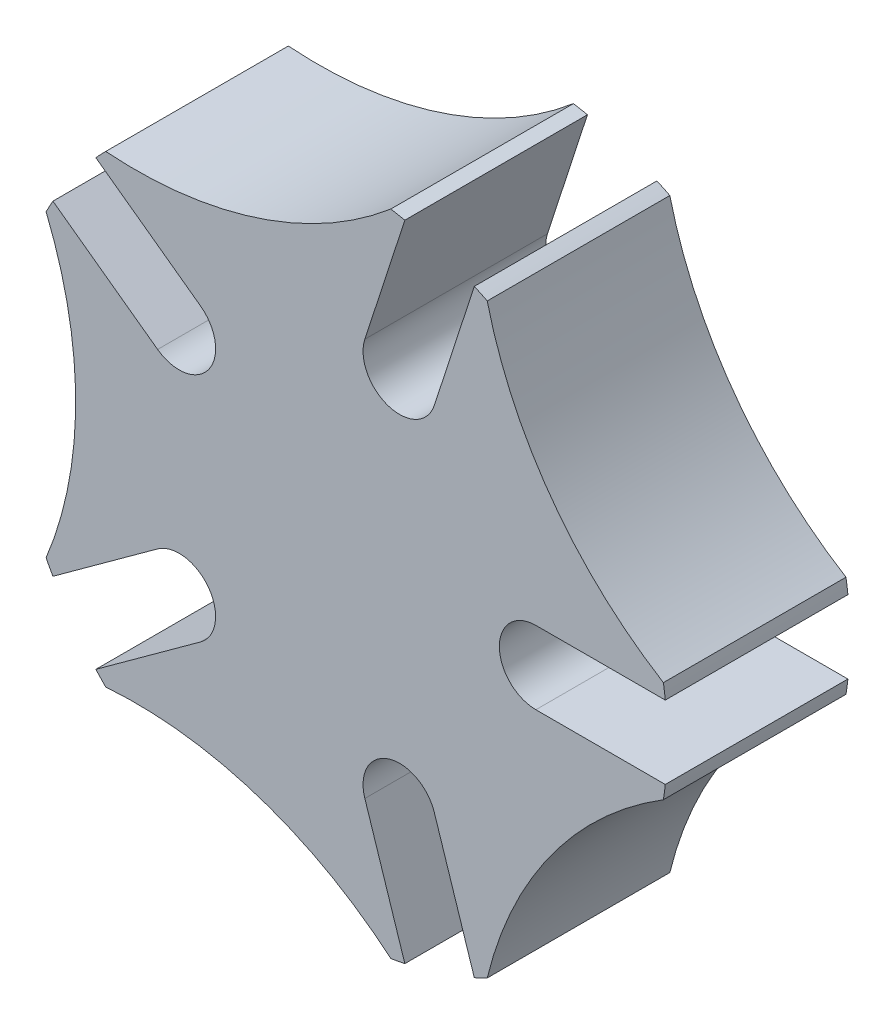
ISO-10303-21;
HEADER;
FILE_DESCRIPTION(('STEP AP214'),'2;1');
FILE_NAME('part.step','',(''),(''),'','','');
FILE_SCHEMA(('AUTOMOTIVE_DESIGN { 1 0 10303 214 1 1 1 1 }'));
ENDSEC;
DATA;
#1=APPLICATION_CONTEXT('core data for automotive mechanical design processes');
#2=APPLICATION_PROTOCOL_DEFINITION('international standard','automotive_design',2000,#1);
#3=PRODUCT_CONTEXT('',#1,'mechanical');
#4=PRODUCT('Part','Part','',(#3));
#5=PRODUCT_RELATED_PRODUCT_CATEGORY('part','',(#4));
#6=PRODUCT_DEFINITION_FORMATION('','',#4);
#7=PRODUCT_DEFINITION_CONTEXT('part definition',#1,'design');
#8=PRODUCT_DEFINITION('design','',#6,#7);
#9=PRODUCT_DEFINITION_SHAPE('','',#8);
#10=(LENGTH_UNIT() NAMED_UNIT(*) SI_UNIT(.MILLI.,.METRE.));
#11=(NAMED_UNIT(*) PLANE_ANGLE_UNIT() SI_UNIT($,.RADIAN.));
#12=(NAMED_UNIT(*) SI_UNIT($,.STERADIAN.) SOLID_ANGLE_UNIT());
#13=UNCERTAINTY_MEASURE_WITH_UNIT(LENGTH_MEASURE(1.E-05),#10,'distance_accuracy_value','');
#14=(GEOMETRIC_REPRESENTATION_CONTEXT(3) GLOBAL_UNCERTAINTY_ASSIGNED_CONTEXT((#13)) GLOBAL_UNIT_ASSIGNED_CONTEXT((#10,
#11,#12)) REPRESENTATION_CONTEXT('',''));
#15=CARTESIAN_POINT('',(0.,0.,0.));
#16=DIRECTION('',(0.,0.,1.));
#17=DIRECTION('',(1.,0.,0.));
#18=AXIS2_PLACEMENT_3D('',#15,#16,#17);
#19=CARTESIAN_POINT('',(-4.36869176962471,3.17404036237936,5.));
#20=DIRECTION('',(0.,0.,-1.));
#21=DIRECTION('',(-1.,0.,0.));
#22=AXIS2_PLACEMENT_3D('',#19,#20,#21);
#23=CYLINDRICAL_SURFACE('',#22,0.999999999999999);
#24=CARTESIAN_POINT('',(-4.36869176962471,3.17404036237936,0.));
#25=DIRECTION('',(0.,0.,1.));
#26=DIRECTION('',(1.,0.,0.));
#27=AXIS2_PLACEMENT_3D('',#24,#25,#26);
#28=CIRCLE('',#27,0.999999999999999);
#29=CARTESIAN_POINT('',(-4.95647702191719,2.36502336800441,0.));
#30=VERTEX_POINT('',#29);
#31=CARTESIAN_POINT('',(-3.78090651733224,3.98305735675431,0.));
#32=VERTEX_POINT('',#31);
#33=EDGE_CURVE('E264',#30,#32,#28,.T.);
#34=ORIENTED_EDGE('',*,*,#33,.F.);
#35=DIRECTION('',(0.,0.,-1.));
#36=VECTOR('',#35,1.);
#37=CARTESIAN_POINT('',(-4.95647702191719,2.36502336800441,5.));
#38=LINE('',#37,#36);
#39=CARTESIAN_POINT('',(-4.95647702191719,2.36502336800441,5.));
#40=VERTEX_POINT('',#39);
#41=EDGE_CURVE('E11',#40,#30,#38,.T.);
#42=ORIENTED_EDGE('',*,*,#41,.F.);
#43=CARTESIAN_POINT('',(-4.36869176962471,3.17404036237936,5.));
#44=DIRECTION('',(0.,0.,1.));
#45=DIRECTION('',(1.,0.,0.));
#46=AXIS2_PLACEMENT_3D('',#43,#44,#45);
#47=CIRCLE('',#46,0.999999999999999);
#48=CARTESIAN_POINT('',(-3.78090651733224,3.98305735675431,5.));
#49=VERTEX_POINT('',#48);
#50=EDGE_CURVE('E328',#40,#49,#47,.T.);
#51=ORIENTED_EDGE('',*,*,#50,.T.);
#52=DIRECTION('',(0.,0.,-1.));
#53=VECTOR('',#52,1.);
#54=CARTESIAN_POINT('',(-3.78090651733224,3.98305735675431,5.));
#55=LINE('',#54,#53);
#56=EDGE_CURVE('E51',#49,#32,#55,.T.);
#57=ORIENTED_EDGE('',*,*,#56,.T.);
#58=EDGE_LOOP('',(#34,#42,#51,#57));
#59=FACE_BOUND('',#58,.T.);
#60=ADVANCED_FACE('F35',(#59),#23,.F.);
#61=CARTESIAN_POINT('',(-0.587785252292473,-0.809016994374945,5.));
#62=DIRECTION('',(-0.587785252292474,-0.809016994374947,0.));
#63=DIRECTION('',(0.809016994374947,-0.587785252292474,0.));
#64=AXIS2_PLACEMENT_3D('',#61,#62,#63);
#65=PLANE('',#64);
#66=DIRECTION('',(-0.809016994374947,0.587785252292474,0.));
#67=VECTOR('',#66,1.);
#68=CARTESIAN_POINT('',(-0.587785252292473,-0.809016994374945,0.));
#69=LINE('',#68,#67);
#70=CARTESIAN_POINT('',(-7.8234126972888,4.44797406121767,0.));
#71=VERTEX_POINT('',#70);
#72=EDGE_CURVE('E266',#30,#71,#69,.T.);
#73=ORIENTED_EDGE('',*,*,#72,.T.);
#74=DIRECTION('',(0.,0.,-1.));
#75=VECTOR('',#74,1.);
#76=CARTESIAN_POINT('',(-7.8234126972888,4.44797406121767,5.));
#77=LINE('',#76,#75);
#78=CARTESIAN_POINT('',(-7.8234126972888,4.44797406121767,5.));
#79=VERTEX_POINT('',#78);
#80=EDGE_CURVE('E43',#79,#71,#77,.T.);
#81=ORIENTED_EDGE('',*,*,#80,.F.);
#82=DIRECTION('',(-0.809016994374947,0.587785252292474,0.));
#83=VECTOR('',#82,1.);
#84=CARTESIAN_POINT('',(-0.587785252292473,-0.809016994374945,5.));
#85=LINE('',#84,#83);
#86=EDGE_CURVE('E407',#40,#79,#85,.T.);
#87=ORIENTED_EDGE('',*,*,#86,.F.);
#88=ORIENTED_EDGE('',*,*,#41,.T.);
#89=EDGE_LOOP('',(#73,#81,#87,#88));
#90=FACE_BOUND('',#89,.T.);
#91=ADVANCED_FACE('F473',(#90),#65,.F.);
#92=CARTESIAN_POINT('',(0.,0.,5.));
#93=DIRECTION('',(0.,0.,-1.));
#94=DIRECTION('',(-1.,0.,0.));
#95=AXIS2_PLACEMENT_3D('',#92,#93,#94);
#96=CYLINDRICAL_SURFACE('',#95,8.99945884380638);
#97=CARTESIAN_POINT('',(0.,0.,0.));
#98=DIRECTION('',(0.,0.,1.));
#99=DIRECTION('',(1.,0.,0.));
#100=AXIS2_PLACEMENT_3D('',#97,#98,#99);
#101=CIRCLE('',#100,8.99945884380638);
#102=CARTESIAN_POINT('',(-8.00972943003791,4.10298597840029,0.));
#103=VERTEX_POINT('',#102);
#104=EDGE_CURVE('E268',#71,#103,#101,.T.);
#105=ORIENTED_EDGE('',*,*,#104,.T.);
#106=DIRECTION('',(0.,0.,-1.));
#107=VECTOR('',#106,1.);
#108=CARTESIAN_POINT('',(-8.00972943003791,4.10298597840029,5.));
#109=LINE('',#108,#107);
#110=CARTESIAN_POINT('',(-8.00972943003791,4.10298597840029,5.));
#111=VERTEX_POINT('',#110);
#112=EDGE_CURVE('E382',#111,#103,#109,.T.);
#113=ORIENTED_EDGE('',*,*,#112,.F.);
#114=CARTESIAN_POINT('',(0.,0.,5.));
#115=DIRECTION('',(0.,0.,1.));
#116=DIRECTION('',(1.,0.,0.));
#117=AXIS2_PLACEMENT_3D('',#114,#115,#116);
#118=CIRCLE('',#117,8.99945884380638);
#119=EDGE_CURVE('E252',#79,#111,#118,.T.);
#120=ORIENTED_EDGE('',*,*,#119,.F.);
#121=ORIENTED_EDGE('',*,*,#80,.T.);
#122=EDGE_LOOP('',(#105,#113,#120,#121));
#123=FACE_BOUND('',#122,.T.);
#124=ADVANCED_FACE('F388',(#123),#96,.T.);
#125=CARTESIAN_POINT('',(-18.,0.,5.));
#126=DIRECTION('',(0.,0.,-1.));
#127=DIRECTION('',(-1.,0.,0.));
#128=AXIS2_PLACEMENT_3D('',#125,#126,#127);
#129=CYLINDRICAL_SURFACE('',#128,10.8);
#130=CARTESIAN_POINT('',(-18.,0.,0.));
#131=DIRECTION('',(0.,0.,1.));
#132=DIRECTION('',(1.,0.,0.));
#133=AXIS2_PLACEMENT_3D('',#130,#131,#132);
#134=CIRCLE('',#133,10.8);
#135=CARTESIAN_POINT('',(-8.00972943003791,-4.1029859784003,0.));
#136=VERTEX_POINT('',#135);
#137=EDGE_CURVE('E271',#136,#103,#134,.T.);
#138=ORIENTED_EDGE('',*,*,#137,.F.);
#139=DIRECTION('',(0.,0.,-1.));
#140=VECTOR('',#139,1.);
#141=CARTESIAN_POINT('',(-8.00972943003791,-4.1029859784003,5.));
#142=LINE('',#141,#140);
#143=CARTESIAN_POINT('',(-8.00972943003791,-4.1029859784003,5.));
#144=VERTEX_POINT('',#143);
#145=EDGE_CURVE('E380',#144,#136,#142,.T.);
#146=ORIENTED_EDGE('',*,*,#145,.F.);
#147=CARTESIAN_POINT('',(-18.,0.,5.));
#148=DIRECTION('',(0.,0.,1.));
#149=DIRECTION('',(1.,0.,0.));
#150=AXIS2_PLACEMENT_3D('',#147,#148,#149);
#151=CIRCLE('',#150,10.8);
#152=EDGE_CURVE('E402',#144,#111,#151,.T.);
#153=ORIENTED_EDGE('',*,*,#152,.T.);
#154=ORIENTED_EDGE('',*,*,#112,.T.);
#155=EDGE_LOOP('',(#138,#146,#153,#154));
#156=FACE_BOUND('',#155,.T.);
#157=ADVANCED_FACE('F398',(#156),#129,.F.);
#158=CARTESIAN_POINT('',(-7.8234126972887,-4.44797406121786,0.));
#159=VERTEX_POINT('',#158);
#160=EDGE_CURVE('E273',#136,#159,#101,.T.);
#161=ORIENTED_EDGE('',*,*,#160,.T.);
#162=DIRECTION('',(0.,0.,-1.));
#163=VECTOR('',#162,1.);
#164=CARTESIAN_POINT('',(-7.8234126972887,-4.44797406121786,5.));
#165=LINE('',#164,#163);
#166=CARTESIAN_POINT('',(-7.8234126972887,-4.44797406121786,5.));
#167=VERTEX_POINT('',#166);
#168=EDGE_CURVE('E378',#167,#159,#165,.T.);
#169=ORIENTED_EDGE('',*,*,#168,.F.);
#170=EDGE_CURVE('E403',#144,#167,#118,.T.);
#171=ORIENTED_EDGE('',*,*,#170,.F.);
#172=ORIENTED_EDGE('',*,*,#145,.T.);
#173=EDGE_LOOP('',(#161,#169,#171,#172));
#174=FACE_BOUND('',#173,.T.);
#175=ADVANCED_FACE('F480',(#174),#96,.T.);
#176=CARTESIAN_POINT('',(-0.587785252292336,0.80901699437476,5.));
#177=DIRECTION('',(0.587785252292472,-0.809016994374948,0.));
#178=DIRECTION('',(0.809016994374948,0.587785252292472,0.));
#179=AXIS2_PLACEMENT_3D('',#176,#177,#178);
#180=PLANE('',#179);
#181=DIRECTION('',(-0.809016994374948,-0.587785252292472,0.));
#182=VECTOR('',#181,1.);
#183=CARTESIAN_POINT('',(-0.587785252292336,0.80901699437476,0.));
#184=LINE('',#183,#182);
#185=CARTESIAN_POINT('',(-4.95647702191687,-2.36502336800445,0.));
#186=VERTEX_POINT('',#185);
#187=EDGE_CURVE('E276',#186,#159,#184,.T.);
#188=ORIENTED_EDGE('',*,*,#187,.F.);
#189=DIRECTION('',(0.,0.,-1.));
#190=VECTOR('',#189,1.);
#191=CARTESIAN_POINT('',(-4.95647702191687,-2.36502336800445,5.));
#192=LINE('',#191,#190);
#193=CARTESIAN_POINT('',(-4.95647702191687,-2.36502336800445,5.));
#194=VERTEX_POINT('',#193);
#195=EDGE_CURVE('E376',#194,#186,#192,.T.);
#196=ORIENTED_EDGE('',*,*,#195,.F.);
#197=DIRECTION('',(-0.809016994374948,-0.587785252292472,0.));
#198=VECTOR('',#197,1.);
#199=CARTESIAN_POINT('',(-0.587785252292336,0.80901699437476,5.));
#200=LINE('',#199,#198);
#201=EDGE_CURVE('E405',#194,#167,#200,.T.);
#202=ORIENTED_EDGE('',*,*,#201,.T.);
#203=ORIENTED_EDGE('',*,*,#168,.T.);
#204=EDGE_LOOP('',(#188,#196,#202,#203));
#205=FACE_BOUND('',#204,.T.);
#206=ADVANCED_FACE('F484',(#205),#180,.T.);
#207=CARTESIAN_POINT('',(-4.36869176962439,-3.1740403623794,5.));
#208=DIRECTION('',(0.,0.,-1.));
#209=DIRECTION('',(-1.,0.,0.));
#210=AXIS2_PLACEMENT_3D('',#207,#208,#209);
#211=CYLINDRICAL_SURFACE('',#210,1.);
#212=CARTESIAN_POINT('',(-4.36869176962439,-3.1740403623794,0.));
#213=DIRECTION('',(0.,0.,1.));
#214=DIRECTION('',(1.,0.,0.));
#215=AXIS2_PLACEMENT_3D('',#212,#213,#214);
#216=CIRCLE('',#215,1.);
#217=CARTESIAN_POINT('',(-3.78090651733192,-3.98305735675435,0.));
#218=VERTEX_POINT('',#217);
#219=EDGE_CURVE('E279',#218,#186,#216,.T.);
#220=ORIENTED_EDGE('',*,*,#219,.F.);
#221=DIRECTION('',(0.,0.,-1.));
#222=VECTOR('',#221,1.);
#223=CARTESIAN_POINT('',(-3.78090651733192,-3.98305735675435,5.));
#224=LINE('',#223,#222);
#225=CARTESIAN_POINT('',(-3.78090651733192,-3.98305735675435,5.));
#226=VERTEX_POINT('',#225);
#227=EDGE_CURVE('E374',#226,#218,#224,.T.);
#228=ORIENTED_EDGE('',*,*,#227,.F.);
#229=CARTESIAN_POINT('',(-4.36869176962439,-3.1740403623794,5.));
#230=DIRECTION('',(0.,0.,1.));
#231=DIRECTION('',(1.,0.,0.));
#232=AXIS2_PLACEMENT_3D('',#229,#230,#231);
#233=CIRCLE('',#232,1.);
#234=EDGE_CURVE('E412',#226,#194,#233,.T.);
#235=ORIENTED_EDGE('',*,*,#234,.T.);
#236=ORIENTED_EDGE('',*,*,#195,.T.);
#237=EDGE_LOOP('',(#220,#228,#235,#236));
#238=FACE_BOUND('',#237,.T.);
#239=ADVANCED_FACE('F487',(#238),#211,.F.);
#240=CARTESIAN_POINT('',(0.587785252292611,-0.809016994375141,5.));
#241=DIRECTION('',(0.587785252292472,-0.809016994374948,0.));
#242=DIRECTION('',(0.809016994374948,0.587785252292472,0.));
#243=AXIS2_PLACEMENT_3D('',#240,#241,#242);
#244=PLANE('',#243);
#245=DIRECTION('',(-0.809016994374949,-0.587785252292472,0.));
#246=VECTOR('',#245,1.);
#247=CARTESIAN_POINT('',(0.587785252292611,-0.809016994375141,0.));
#248=LINE('',#247,#246);
#249=CARTESIAN_POINT('',(-6.64784219270371,-6.06600804996772,0.));
#250=VERTEX_POINT('',#249);
#251=EDGE_CURVE('E282',#218,#250,#248,.T.);
#252=ORIENTED_EDGE('',*,*,#251,.T.);
#253=DIRECTION('',(0.,0.,-1.));
#254=VECTOR('',#253,1.);
#255=CARTESIAN_POINT('',(-6.64784219270371,-6.06600804996772,5.));
#256=LINE('',#255,#254);
#257=CARTESIAN_POINT('',(-6.64784219270371,-6.06600804996772,5.));
#258=VERTEX_POINT('',#257);
#259=EDGE_CURVE('E371',#258,#250,#256,.T.);
#260=ORIENTED_EDGE('',*,*,#259,.F.);
#261=DIRECTION('',(-0.809016994374949,-0.587785252292472,0.));
#262=VECTOR('',#261,1.);
#263=CARTESIAN_POINT('',(0.587785252292611,-0.809016994375141,5.));
#264=LINE('',#263,#262);
#265=EDGE_CURVE('E415',#226,#258,#264,.T.);
#266=ORIENTED_EDGE('',*,*,#265,.F.);
#267=ORIENTED_EDGE('',*,*,#227,.T.);
#268=EDGE_LOOP('',(#252,#260,#266,#267));
#269=FACE_BOUND('',#268,.T.);
#270=ADVANCED_FACE('F491',(#269),#244,.F.);
#271=CARTESIAN_POINT('',(-6.3773140652522,-6.34981297319074,0.));
#272=VERTEX_POINT('',#271);
#273=EDGE_CURVE('E284',#250,#272,#101,.T.);
#274=ORIENTED_EDGE('',*,*,#273,.T.);
#275=DIRECTION('',(0.,0.,-1.));
#276=VECTOR('',#275,1.);
#277=CARTESIAN_POINT('',(-6.3773140652522,-6.34981297319074,5.));
#278=LINE('',#277,#276);
#279=CARTESIAN_POINT('',(-6.3773140652522,-6.34981297319074,5.));
#280=VERTEX_POINT('',#279);
#281=EDGE_CURVE('E369',#280,#272,#278,.T.);
#282=ORIENTED_EDGE('',*,*,#281,.F.);
#283=EDGE_CURVE('E406',#258,#280,#118,.T.);
#284=ORIENTED_EDGE('',*,*,#283,.F.);
#285=ORIENTED_EDGE('',*,*,#259,.T.);
#286=EDGE_LOOP('',(#274,#282,#284,#285));
#287=FACE_BOUND('',#286,.T.);
#288=ADVANCED_FACE('F495',(#287),#96,.T.);
#289=CARTESIAN_POINT('',(-5.56230589874925,-17.1190172933127,5.));
#290=DIRECTION('',(0.,0.,-1.));
#291=DIRECTION('',(-1.,0.,0.));
#292=AXIS2_PLACEMENT_3D('',#289,#290,#291);
#293=CYLINDRICAL_SURFACE('',#292,10.8);
#294=CARTESIAN_POINT('',(-5.56230589874925,-17.1190172933127,0.));
#295=DIRECTION('',(0.,0.,1.));
#296=DIRECTION('',(1.,0.,0.));
#297=AXIS2_PLACEMENT_3D('',#294,#295,#296);
#298=CIRCLE('',#297,10.8);
#299=CARTESIAN_POINT('',(1.42702903679827,-8.88559776320645,0.));
#300=VERTEX_POINT('',#299);
#301=EDGE_CURVE('E285',#300,#272,#298,.T.);
#302=ORIENTED_EDGE('',*,*,#301,.F.);
#303=DIRECTION('',(0.,0.,-1.));
#304=VECTOR('',#303,1.);
#305=CARTESIAN_POINT('',(1.42702903679827,-8.88559776320645,5.));
#306=LINE('',#305,#304);
#307=CARTESIAN_POINT('',(1.42702903679827,-8.88559776320645,5.));
#308=VERTEX_POINT('',#307);
#309=EDGE_CURVE('E367',#308,#300,#306,.T.);
#310=ORIENTED_EDGE('',*,*,#309,.F.);
#311=CARTESIAN_POINT('',(-5.56230589874925,-17.1190172933127,5.));
#312=DIRECTION('',(0.,0.,1.));
#313=DIRECTION('',(1.,0.,0.));
#314=AXIS2_PLACEMENT_3D('',#311,#312,#313);
#315=CIRCLE('',#314,10.8);
#316=EDGE_CURVE('E417',#308,#280,#315,.T.);
#317=ORIENTED_EDGE('',*,*,#316,.T.);
#318=ORIENTED_EDGE('',*,*,#281,.T.);
#319=EDGE_LOOP('',(#302,#310,#317,#318));
#320=FACE_BOUND('',#319,.T.);
#321=ADVANCED_FACE('F497',(#320),#293,.F.);
#322=CARTESIAN_POINT('',(1.8127072377624,-8.81500720087787,0.));
#323=VERTEX_POINT('',#322);
#324=EDGE_CURVE('E288',#300,#323,#101,.T.);
#325=ORIENTED_EDGE('',*,*,#324,.T.);
#326=DIRECTION('',(0.,0.,-1.));
#327=VECTOR('',#326,1.);
#328=CARTESIAN_POINT('',(1.8127072377624,-8.81500720087787,5.));
#329=LINE('',#328,#327);
#330=CARTESIAN_POINT('',(1.8127072377624,-8.81500720087787,5.));
#331=VERTEX_POINT('',#330);
#332=EDGE_CURVE('E365',#331,#323,#329,.T.);
#333=ORIENTED_EDGE('',*,*,#332,.F.);
#334=EDGE_CURVE('E420',#308,#331,#118,.T.);
#335=ORIENTED_EDGE('',*,*,#334,.F.);
#336=ORIENTED_EDGE('',*,*,#309,.T.);
#337=EDGE_LOOP('',(#325,#333,#335,#336));
#338=FACE_BOUND('',#337,.T.);
#339=ADVANCED_FACE('F500',(#338),#96,.T.);
#340=CARTESIAN_POINT('',(-0.95105651629465,-0.309016994374783,5.));
#341=DIRECTION('',(0.951056516295154,0.309016994374946,0.));
#342=DIRECTION('',(-0.309016994374946,0.951056516295154,0.));
#343=AXIS2_PLACEMENT_3D('',#340,#341,#342);
#344=PLANE('',#343);
#345=DIRECTION('',(0.309016994374946,-0.951056516295154,0.));
#346=VECTOR('',#345,1.);
#347=CARTESIAN_POINT('',(-0.95105651629465,-0.309016994374783,0.));
#348=LINE('',#347,#346);
#349=CARTESIAN_POINT('',(0.717635253330034,-5.44472218236854,0.));
#350=VERTEX_POINT('',#349);
#351=EDGE_CURVE('E289',#350,#323,#348,.T.);
#352=ORIENTED_EDGE('',*,*,#351,.F.);
#353=DIRECTION('',(0.,0.,-1.));
#354=VECTOR('',#353,1.);
#355=CARTESIAN_POINT('',(0.717635253330034,-5.44472218236854,5.));
#356=LINE('',#355,#354);
#357=CARTESIAN_POINT('',(0.717635253330034,-5.44472218236854,5.));
#358=VERTEX_POINT('',#357);
#359=EDGE_CURVE('E363',#358,#350,#356,.T.);
#360=ORIENTED_EDGE('',*,*,#359,.F.);
#361=DIRECTION('',(0.309016994374946,-0.951056516295154,0.));
#362=VECTOR('',#361,1.);
#363=CARTESIAN_POINT('',(-0.95105651629465,-0.309016994374783,5.));
#364=LINE('',#363,#362);
#365=EDGE_CURVE('E421',#358,#331,#364,.T.);
#366=ORIENTED_EDGE('',*,*,#365,.T.);
#367=ORIENTED_EDGE('',*,*,#332,.T.);
#368=EDGE_LOOP('',(#352,#360,#366,#367));
#369=FACE_BOUND('',#368,.T.);
#370=ADVANCED_FACE('F502',(#369),#344,.T.);
#371=CARTESIAN_POINT('',(1.66869176962519,-5.13570518799359,5.));
#372=DIRECTION('',(0.,0.,-1.));
#373=DIRECTION('',(-1.,0.,0.));
#374=AXIS2_PLACEMENT_3D('',#371,#372,#373);
#375=CYLINDRICAL_SURFACE('',#374,1.);
#376=CARTESIAN_POINT('',(1.66869176962519,-5.13570518799359,0.));
#377=DIRECTION('',(0.,0.,1.));
#378=DIRECTION('',(1.,0.,0.));
#379=AXIS2_PLACEMENT_3D('',#376,#377,#378);
#380=CIRCLE('',#379,1.);
#381=CARTESIAN_POINT('',(2.61974828592034,-4.82668819361864,0.));
#382=VERTEX_POINT('',#381);
#383=EDGE_CURVE('E292',#382,#350,#380,.T.);
#384=ORIENTED_EDGE('',*,*,#383,.F.);
#385=DIRECTION('',(0.,0.,-1.));
#386=VECTOR('',#385,1.);
#387=CARTESIAN_POINT('',(2.61974828592034,-4.82668819361864,5.));
#388=LINE('',#387,#386);
#389=CARTESIAN_POINT('',(2.61974828592034,-4.82668819361864,5.));
#390=VERTEX_POINT('',#389);
#391=EDGE_CURVE('E361',#390,#382,#388,.T.);
#392=ORIENTED_EDGE('',*,*,#391,.F.);
#393=CARTESIAN_POINT('',(1.66869176962519,-5.13570518799359,5.));
#394=DIRECTION('',(0.,0.,1.));
#395=DIRECTION('',(1.,0.,0.));
#396=AXIS2_PLACEMENT_3D('',#393,#394,#395);
#397=CIRCLE('',#396,1.);
#398=EDGE_CURVE('E424',#390,#358,#397,.T.);
#399=ORIENTED_EDGE('',*,*,#398,.T.);
#400=ORIENTED_EDGE('',*,*,#359,.T.);
#401=EDGE_LOOP('',(#384,#392,#399,#400));
#402=FACE_BOUND('',#401,.T.);
#403=ADVANCED_FACE('F505',(#402),#375,.F.);
#404=CARTESIAN_POINT('',(0.951056516295658,0.30901699437511,5.));
#405=DIRECTION('',(0.951056516295154,0.309016994374946,0.));
#406=DIRECTION('',(-0.309016994374946,0.951056516295154,0.));
#407=AXIS2_PLACEMENT_3D('',#404,#405,#406);
#408=PLANE('',#407);
#409=DIRECTION('',(0.309016994374946,-0.951056516295154,0.));
#410=VECTOR('',#409,1.);
#411=CARTESIAN_POINT('',(0.951056516295658,0.30901699437511,0.));
#412=LINE('',#411,#410);
#413=CARTESIAN_POINT('',(3.71482027035267,-8.19697321212787,0.));
#414=VERTEX_POINT('',#413);
#415=EDGE_CURVE('E295',#382,#414,#412,.T.);
#416=ORIENTED_EDGE('',*,*,#415,.T.);
#417=DIRECTION('',(0.,0.,-1.));
#418=VECTOR('',#417,1.);
#419=CARTESIAN_POINT('',(3.71482027035267,-8.19697321212787,5.));
#420=LINE('',#419,#418);
#421=CARTESIAN_POINT('',(3.71482027035267,-8.19697321212787,5.));
#422=VERTEX_POINT('',#421);
#423=EDGE_CURVE('E358',#422,#414,#420,.T.);
#424=ORIENTED_EDGE('',*,*,#423,.F.);
#425=DIRECTION('',(0.309016994374946,-0.951056516295154,0.));
#426=VECTOR('',#425,1.);
#427=CARTESIAN_POINT('',(0.951056516295658,0.30901699437511,5.));
#428=LINE('',#427,#426);
#429=EDGE_CURVE('E427',#390,#422,#428,.T.);
#430=ORIENTED_EDGE('',*,*,#429,.F.);
#431=ORIENTED_EDGE('',*,*,#391,.T.);
#432=EDGE_LOOP('',(#416,#424,#430,#431));
#433=FACE_BOUND('',#432,.T.);
#434=ADVANCED_FACE('F509',(#433),#408,.F.);
#435=CARTESIAN_POINT('',(4.06833258077895,-8.02738621803744,0.));
#436=VERTEX_POINT('',#435);
#437=EDGE_CURVE('E297',#414,#436,#101,.T.);
#438=ORIENTED_EDGE('',*,*,#437,.T.);
#439=DIRECTION('',(0.,0.,-1.));
#440=VECTOR('',#439,1.);
#441=CARTESIAN_POINT('',(4.06833258077895,-8.02738621803744,5.));
#442=LINE('',#441,#440);
#443=CARTESIAN_POINT('',(4.06833258077895,-8.02738621803744,5.));
#444=VERTEX_POINT('',#443);
#445=EDGE_CURVE('E356',#444,#436,#442,.T.);
#446=ORIENTED_EDGE('',*,*,#445,.F.);
#447=EDGE_CURVE('E429',#422,#444,#118,.T.);
#448=ORIENTED_EDGE('',*,*,#447,.F.);
#449=ORIENTED_EDGE('',*,*,#423,.T.);
#450=EDGE_LOOP('',(#438,#446,#448,#449));
#451=FACE_BOUND('',#450,.T.);
#452=ADVANCED_FACE('F513',(#451),#96,.T.);
#453=CARTESIAN_POINT('',(14.5623058987492,-10.5801345412643,5.));
#454=DIRECTION('',(0.,0.,-1.));
#455=DIRECTION('',(-1.,0.,0.));
#456=AXIS2_PLACEMENT_3D('',#453,#454,#455);
#457=CYLINDRICAL_SURFACE('',#456,10.8000000000004);
#458=CARTESIAN_POINT('',(14.5623058987492,-10.5801345412643,0.));
#459=DIRECTION('',(0.,0.,1.));
#460=DIRECTION('',(1.,0.,0.));
#461=AXIS2_PLACEMENT_3D('',#458,#459,#460);
#462=CIRCLE('',#461,10.8000000000004);
#463=CARTESIAN_POINT('',(8.89168187771244,-1.38861544962065,0.));
#464=VERTEX_POINT('',#463);
#465=EDGE_CURVE('E298',#464,#436,#462,.T.);
#466=ORIENTED_EDGE('',*,*,#465,.F.);
#467=DIRECTION('',(0.,0.,-1.));
#468=VECTOR('',#467,1.);
#469=CARTESIAN_POINT('',(8.89168187771244,-1.38861544962065,5.));
#470=LINE('',#469,#468);
#471=CARTESIAN_POINT('',(8.89168187771244,-1.38861544962065,5.));
#472=VERTEX_POINT('',#471);
#473=EDGE_CURVE('E354',#472,#464,#470,.T.);
#474=ORIENTED_EDGE('',*,*,#473,.F.);
#475=CARTESIAN_POINT('',(14.5623058987492,-10.5801345412643,5.));
#476=DIRECTION('',(0.,0.,1.));
#477=DIRECTION('',(1.,0.,0.));
#478=AXIS2_PLACEMENT_3D('',#475,#476,#477);
#479=CIRCLE('',#478,10.8000000000004);
#480=EDGE_CURVE('E430',#472,#444,#479,.T.);
#481=ORIENTED_EDGE('',*,*,#480,.T.);
#482=ORIENTED_EDGE('',*,*,#445,.T.);
#483=EDGE_LOOP('',(#466,#474,#481,#482));
#484=FACE_BOUND('',#483,.T.);
#485=ADVANCED_FACE('F515',(#484),#457,.F.);
#486=CARTESIAN_POINT('',(8.94372738187864,-0.999999999999532,0.));
#487=VERTEX_POINT('',#486);
#488=EDGE_CURVE('E301',#464,#487,#101,.T.);
#489=ORIENTED_EDGE('',*,*,#488,.T.);
#490=DIRECTION('',(0.,0.,-1.));
#491=VECTOR('',#490,1.);
#492=CARTESIAN_POINT('',(8.94372738187864,-0.999999999999532,5.));
#493=LINE('',#492,#491);
#494=CARTESIAN_POINT('',(8.94372738187864,-0.999999999999532,5.));
#495=VERTEX_POINT('',#494);
#496=EDGE_CURVE('E352',#495,#487,#493,.T.);
#497=ORIENTED_EDGE('',*,*,#496,.F.);
#498=EDGE_CURVE('E433',#472,#495,#118,.T.);
#499=ORIENTED_EDGE('',*,*,#498,.F.);
#500=ORIENTED_EDGE('',*,*,#473,.T.);
#501=EDGE_LOOP('',(#489,#497,#499,#500));
#502=FACE_BOUND('',#501,.T.);
#503=ADVANCED_FACE('F518',(#502),#96,.T.);
#504=CARTESIAN_POINT('',(0.,-0.999999999999522,5.));
#505=DIRECTION('',(0.,1.,0.));
#506=DIRECTION('',(-1.,0.,0.));
#507=AXIS2_PLACEMENT_3D('',#504,#505,#506);
#508=PLANE('',#507);
#509=DIRECTION('',(1.,0.,0.));
#510=VECTOR('',#509,1.);
#511=CARTESIAN_POINT('',(0.,-0.999999999999522,0.));
#512=LINE('',#511,#510);
#513=CARTESIAN_POINT('',(5.40000000000024,-0.999999999999528,0.));
#514=VERTEX_POINT('',#513);
#515=EDGE_CURVE('E302',#514,#487,#512,.T.);
#516=ORIENTED_EDGE('',*,*,#515,.F.);
#517=DIRECTION('',(0.,0.,-1.));
#518=VECTOR('',#517,1.);
#519=CARTESIAN_POINT('',(5.40000000000024,-0.999999999999528,5.));
#520=LINE('',#519,#518);
#521=CARTESIAN_POINT('',(5.40000000000024,-0.999999999999528,5.));
#522=VERTEX_POINT('',#521);
#523=EDGE_CURVE('E350',#522,#514,#520,.T.);
#524=ORIENTED_EDGE('',*,*,#523,.F.);
#525=DIRECTION('',(1.,0.,0.));
#526=VECTOR('',#525,1.);
#527=CARTESIAN_POINT('',(0.,-0.999999999999522,5.));
#528=LINE('',#527,#526);
#529=EDGE_CURVE('E434',#522,#495,#528,.T.);
#530=ORIENTED_EDGE('',*,*,#529,.T.);
#531=ORIENTED_EDGE('',*,*,#496,.T.);
#532=EDGE_LOOP('',(#516,#524,#530,#531));
#533=FACE_BOUND('',#532,.T.);
#534=ADVANCED_FACE('F520',(#533),#508,.T.);
#535=CARTESIAN_POINT('',(5.40000000000024,4.71519524813946E-13,5.));
#536=DIRECTION('',(0.,0.,-1.));
#537=DIRECTION('',(-1.,0.,0.));
#538=AXIS2_PLACEMENT_3D('',#535,#536,#537);
#539=CYLINDRICAL_SURFACE('',#538,1.);
#540=CARTESIAN_POINT('',(5.40000000000024,4.71519524813946E-13,0.));
#541=DIRECTION('',(0.,0.,1.));
#542=DIRECTION('',(1.,0.,0.));
#543=AXIS2_PLACEMENT_3D('',#540,#541,#542);
#544=CIRCLE('',#543,1.);
#545=CARTESIAN_POINT('',(5.40000000000024,1.00000000000047,0.));
#546=VERTEX_POINT('',#545);
#547=EDGE_CURVE('E305',#546,#514,#544,.T.);
#548=ORIENTED_EDGE('',*,*,#547,.F.);
#549=DIRECTION('',(0.,0.,-1.));
#550=VECTOR('',#549,1.);
#551=CARTESIAN_POINT('',(5.40000000000024,1.00000000000047,5.));
#552=LINE('',#551,#550);
#553=CARTESIAN_POINT('',(5.40000000000024,1.00000000000047,5.));
#554=VERTEX_POINT('',#553);
#555=EDGE_CURVE('E348',#554,#546,#552,.T.);
#556=ORIENTED_EDGE('',*,*,#555,.F.);
#557=CARTESIAN_POINT('',(5.40000000000024,4.71519524813946E-13,5.));
#558=DIRECTION('',(0.,0.,1.));
#559=DIRECTION('',(1.,0.,0.));
#560=AXIS2_PLACEMENT_3D('',#557,#558,#559);
#561=CIRCLE('',#560,1.);
#562=EDGE_CURVE('E437',#554,#522,#561,.T.);
#563=ORIENTED_EDGE('',*,*,#562,.T.);
#564=ORIENTED_EDGE('',*,*,#523,.T.);
#565=EDGE_LOOP('',(#548,#556,#563,#564));
#566=FACE_BOUND('',#565,.T.);
#567=ADVANCED_FACE('F523',(#566),#539,.F.);
#568=CARTESIAN_POINT('',(0.,1.00000000000048,5.));
#569=DIRECTION('',(0.,1.,0.));
#570=DIRECTION('',(-1.,0.,0.));
#571=AXIS2_PLACEMENT_3D('',#568,#569,#570);
#572=PLANE('',#571);
#573=DIRECTION('',(1.,0.,0.));
#574=VECTOR('',#573,1.);
#575=CARTESIAN_POINT('',(0.,1.00000000000048,0.));
#576=LINE('',#575,#574);
#577=CARTESIAN_POINT('',(8.94372738187854,1.00000000000047,0.));
#578=VERTEX_POINT('',#577);
#579=EDGE_CURVE('E308',#546,#578,#576,.T.);
#580=ORIENTED_EDGE('',*,*,#579,.T.);
#581=DIRECTION('',(0.,0.,-1.));
#582=VECTOR('',#581,1.);
#583=CARTESIAN_POINT('',(8.94372738187854,1.00000000000047,5.));
#584=LINE('',#583,#582);
#585=CARTESIAN_POINT('',(8.94372738187854,1.00000000000047,5.));
#586=VERTEX_POINT('',#585);
#587=EDGE_CURVE('E345',#586,#578,#584,.T.);
#588=ORIENTED_EDGE('',*,*,#587,.F.);
#589=DIRECTION('',(1.,0.,0.));
#590=VECTOR('',#589,1.);
#591=CARTESIAN_POINT('',(0.,1.00000000000048,5.));
#592=LINE('',#591,#590);
#593=EDGE_CURVE('E440',#554,#586,#592,.T.);
#594=ORIENTED_EDGE('',*,*,#593,.F.);
#595=ORIENTED_EDGE('',*,*,#555,.T.);
#596=EDGE_LOOP('',(#580,#588,#594,#595));
#597=FACE_BOUND('',#596,.T.);
#598=ADVANCED_FACE('F527',(#597),#572,.F.);
#599=CARTESIAN_POINT('',(8.89168187771247,1.38861544962041,0.));
#600=VERTEX_POINT('',#599);
#601=EDGE_CURVE('E310',#578,#600,#101,.T.);
#602=ORIENTED_EDGE('',*,*,#601,.T.);
#603=DIRECTION('',(0.,0.,-1.));
#604=VECTOR('',#603,1.);
#605=CARTESIAN_POINT('',(8.89168187771247,1.38861544962041,5.));
#606=LINE('',#605,#604);
#607=CARTESIAN_POINT('',(8.89168187771247,1.38861544962041,5.));
#608=VERTEX_POINT('',#607);
#609=EDGE_CURVE('E343',#608,#600,#606,.T.);
#610=ORIENTED_EDGE('',*,*,#609,.F.);
#611=EDGE_CURVE('E442',#586,#608,#118,.T.);
#612=ORIENTED_EDGE('',*,*,#611,.F.);
#613=ORIENTED_EDGE('',*,*,#587,.T.);
#614=EDGE_LOOP('',(#602,#610,#612,#613));
#615=FACE_BOUND('',#614,.T.);
#616=ADVANCED_FACE('F531',(#615),#96,.T.);
#617=CARTESIAN_POINT('',(14.5623058987494,10.5801345412648,5.));
#618=DIRECTION('',(0.,0.,-1.));
#619=DIRECTION('',(-1.,0.,0.));
#620=AXIS2_PLACEMENT_3D('',#617,#618,#619);
#621=CYLINDRICAL_SURFACE('',#620,10.8000000000011);
#622=CARTESIAN_POINT('',(14.5623058987494,10.5801345412648,0.));
#623=DIRECTION('',(0.,0.,1.));
#624=DIRECTION('',(1.,0.,0.));
#625=AXIS2_PLACEMENT_3D('',#622,#623,#624);
#626=CIRCLE('',#625,10.8000000000011);
#627=CARTESIAN_POINT('',(4.06833258077847,8.02738621803768,0.));
#628=VERTEX_POINT('',#627);
#629=EDGE_CURVE('E311',#628,#600,#626,.T.);
#630=ORIENTED_EDGE('',*,*,#629,.F.);
#631=DIRECTION('',(0.,0.,-1.));
#632=VECTOR('',#631,1.);
#633=CARTESIAN_POINT('',(4.06833258077847,8.02738621803768,5.));
#634=LINE('',#633,#632);
#635=CARTESIAN_POINT('',(4.06833258077847,8.02738621803768,5.));
#636=VERTEX_POINT('',#635);
#637=EDGE_CURVE('E341',#636,#628,#634,.T.);
#638=ORIENTED_EDGE('',*,*,#637,.F.);
#639=CARTESIAN_POINT('',(14.5623058987494,10.5801345412648,5.));
#640=DIRECTION('',(0.,0.,1.));
#641=DIRECTION('',(1.,0.,0.));
#642=AXIS2_PLACEMENT_3D('',#639,#640,#641);
#643=CIRCLE('',#642,10.8000000000011);
#644=EDGE_CURVE('E443',#636,#608,#643,.T.);
#645=ORIENTED_EDGE('',*,*,#644,.T.);
#646=ORIENTED_EDGE('',*,*,#609,.T.);
#647=EDGE_LOOP('',(#630,#638,#645,#646));
#648=FACE_BOUND('',#647,.T.);
#649=ADVANCED_FACE('F533',(#648),#621,.F.);
#650=CARTESIAN_POINT('',(3.71482027035207,8.19697321212814,0.));
#651=VERTEX_POINT('',#650);
#652=EDGE_CURVE('E314',#628,#651,#101,.T.);
#653=ORIENTED_EDGE('',*,*,#652,.T.);
#654=DIRECTION('',(0.,0.,-1.));
#655=VECTOR('',#654,1.);
#656=CARTESIAN_POINT('',(3.71482027035207,8.19697321212814,5.));
#657=LINE('',#656,#655);
#658=CARTESIAN_POINT('',(3.71482027035207,8.19697321212814,5.));
#659=VERTEX_POINT('',#658);
#660=EDGE_CURVE('E339',#659,#651,#657,.T.);
#661=ORIENTED_EDGE('',*,*,#660,.F.);
#662=EDGE_CURVE('E259',#636,#659,#118,.T.);
#663=ORIENTED_EDGE('',*,*,#662,.F.);
#664=ORIENTED_EDGE('',*,*,#637,.T.);
#665=EDGE_LOOP('',(#653,#661,#663,#664));
#666=FACE_BOUND('',#665,.T.);
#667=ADVANCED_FACE('F536',(#666),#96,.T.);
#668=CARTESIAN_POINT('',(0.951056516295009,-0.309016994374902,5.));
#669=DIRECTION('',(-0.951056516295153,0.309016994374949,0.));
#670=DIRECTION('',(-0.309016994374949,-0.951056516295153,0.));
#671=AXIS2_PLACEMENT_3D('',#668,#669,#670);
#672=PLANE('',#671);
#673=DIRECTION('',(0.309016994374949,0.951056516295153,0.));
#674=VECTOR('',#673,1.);
#675=CARTESIAN_POINT('',(0.951056516295009,-0.309016994374902,0.));
#676=LINE('',#675,#674);
#677=CARTESIAN_POINT('',(2.61974828591982,4.82668819361921,0.));
#678=VERTEX_POINT('',#677);
#679=EDGE_CURVE('E315',#678,#651,#676,.T.);
#680=ORIENTED_EDGE('',*,*,#679,.F.);
#681=DIRECTION('',(0.,0.,-1.));
#682=VECTOR('',#681,1.);
#683=CARTESIAN_POINT('',(2.61974828591982,4.82668819361921,5.));
#684=LINE('',#683,#682);
#685=CARTESIAN_POINT('',(2.61974828591982,4.82668819361921,5.));
#686=VERTEX_POINT('',#685);
#687=EDGE_CURVE('E337',#686,#678,#684,.T.);
#688=ORIENTED_EDGE('',*,*,#687,.F.);
#689=DIRECTION('',(0.309016994374949,0.951056516295153,0.));
#690=VECTOR('',#689,1.);
#691=CARTESIAN_POINT('',(0.951056516295009,-0.309016994374902,5.));
#692=LINE('',#691,#690);
#693=EDGE_CURVE('E446',#686,#659,#692,.T.);
#694=ORIENTED_EDGE('',*,*,#693,.T.);
#695=ORIENTED_EDGE('',*,*,#660,.T.);
#696=EDGE_LOOP('',(#680,#688,#694,#695));
#697=FACE_BOUND('',#696,.T.);
#698=ADVANCED_FACE('F538',(#697),#672,.T.);
#699=CARTESIAN_POINT('',(1.66869176962467,5.13570518799416,5.));
#700=DIRECTION('',(0.,0.,-1.));
#701=DIRECTION('',(-1.,0.,0.));
#702=AXIS2_PLACEMENT_3D('',#699,#700,#701);
#703=CYLINDRICAL_SURFACE('',#702,1.);
#704=CARTESIAN_POINT('',(1.66869176962467,5.13570518799416,0.));
#705=DIRECTION('',(0.,0.,1.));
#706=DIRECTION('',(1.,0.,0.));
#707=AXIS2_PLACEMENT_3D('',#704,#705,#706);
#708=CIRCLE('',#707,1.);
#709=CARTESIAN_POINT('',(0.717635253329518,5.4447221823691,0.));
#710=VERTEX_POINT('',#709);
#711=EDGE_CURVE('E318',#710,#678,#708,.T.);
#712=ORIENTED_EDGE('',*,*,#711,.F.);
#713=DIRECTION('',(0.,0.,-1.));
#714=VECTOR('',#713,1.);
#715=CARTESIAN_POINT('',(0.717635253329518,5.4447221823691,5.));
#716=LINE('',#715,#714);
#717=CARTESIAN_POINT('',(0.717635253329518,5.4447221823691,5.));
#718=VERTEX_POINT('',#717);
#719=EDGE_CURVE('E335',#718,#710,#716,.T.);
#720=ORIENTED_EDGE('',*,*,#719,.F.);
#721=CARTESIAN_POINT('',(1.66869176962467,5.13570518799416,5.));
#722=DIRECTION('',(0.,0.,1.));
#723=DIRECTION('',(1.,0.,0.));
#724=AXIS2_PLACEMENT_3D('',#721,#722,#723);
#725=CIRCLE('',#724,1.);
#726=EDGE_CURVE('E448',#718,#686,#725,.T.);
#727=ORIENTED_EDGE('',*,*,#726,.T.);
#728=ORIENTED_EDGE('',*,*,#687,.T.);
#729=EDGE_LOOP('',(#712,#720,#727,#728));
#730=FACE_BOUND('',#729,.T.);
#731=ADVANCED_FACE('F541',(#730),#703,.F.);
#732=CARTESIAN_POINT('',(-0.951056516295297,0.309016994374995,5.));
#733=DIRECTION('',(-0.951056516295153,0.309016994374949,0.));
#734=DIRECTION('',(-0.309016994374949,-0.951056516295153,0.));
#735=AXIS2_PLACEMENT_3D('',#732,#733,#734);
#736=PLANE('',#735);
#737=DIRECTION('',(0.309016994374949,0.951056516295153,0.));
#738=VECTOR('',#737,1.);
#739=CARTESIAN_POINT('',(-0.951056516295297,0.309016994374995,0.));
#740=LINE('',#739,#738);
#741=CARTESIAN_POINT('',(1.81270723776175,8.81500720087801,0.));
#742=VERTEX_POINT('',#741);
#743=EDGE_CURVE('E321',#710,#742,#740,.T.);
#744=ORIENTED_EDGE('',*,*,#743,.T.);
#745=DIRECTION('',(0.,0.,-1.));
#746=VECTOR('',#745,1.);
#747=CARTESIAN_POINT('',(1.81270723776175,8.81500720087801,5.));
#748=LINE('',#747,#746);
#749=CARTESIAN_POINT('',(1.81270723776175,8.81500720087801,5.));
#750=VERTEX_POINT('',#749);
#751=EDGE_CURVE('E332',#750,#742,#748,.T.);
#752=ORIENTED_EDGE('',*,*,#751,.F.);
#753=DIRECTION('',(0.309016994374949,0.951056516295153,0.));
#754=VECTOR('',#753,1.);
#755=CARTESIAN_POINT('',(-0.951056516295297,0.309016994374995,5.));
#756=LINE('',#755,#754);
#757=EDGE_CURVE('E258',#718,#750,#756,.T.);
#758=ORIENTED_EDGE('',*,*,#757,.F.);
#759=ORIENTED_EDGE('',*,*,#719,.T.);
#760=EDGE_LOOP('',(#744,#752,#758,#759));
#761=FACE_BOUND('',#760,.T.);
#762=ADVANCED_FACE('F456',(#761),#736,.F.);
#763=CARTESIAN_POINT('',(1.42702903679923,8.8855977632063,0.));
#764=VERTEX_POINT('',#763);
#765=EDGE_CURVE('E323',#742,#764,#101,.T.);
#766=ORIENTED_EDGE('',*,*,#765,.T.);
#767=DIRECTION('',(0.,0.,-1.));
#768=VECTOR('',#767,1.);
#769=CARTESIAN_POINT('',(1.42702903679923,8.8855977632063,5.));
#770=LINE('',#769,#768);
#771=CARTESIAN_POINT('',(1.42702903679923,8.8855977632063,5.));
#772=VERTEX_POINT('',#771);
#773=EDGE_CURVE('E243',#772,#764,#770,.T.);
#774=ORIENTED_EDGE('',*,*,#773,.F.);
#775=EDGE_CURVE('E251',#750,#772,#118,.T.);
#776=ORIENTED_EDGE('',*,*,#775,.F.);
#777=ORIENTED_EDGE('',*,*,#751,.T.);
#778=EDGE_LOOP('',(#766,#774,#776,#777));
#779=FACE_BOUND('',#778,.T.);
#780=ADVANCED_FACE('F461',(#779),#96,.T.);
#781=CARTESIAN_POINT('',(-5.56230589874911,17.1190172933131,5.));
#782=DIRECTION('',(0.,0.,-1.));
#783=DIRECTION('',(-1.,0.,0.));
#784=AXIS2_PLACEMENT_3D('',#781,#782,#783);
#785=CYLINDRICAL_SURFACE('',#784,10.8000000000009);
#786=CARTESIAN_POINT('',(-5.56230589874911,17.1190172933131,0.));
#787=DIRECTION('',(0.,0.,1.));
#788=DIRECTION('',(1.,0.,0.));
#789=AXIS2_PLACEMENT_3D('',#786,#787,#788);
#790=CIRCLE('',#789,10.8000000000009);
#791=CARTESIAN_POINT('',(-6.3773140652527,6.34981297319023,0.));
#792=VERTEX_POINT('',#791);
#793=EDGE_CURVE('E240',#792,#764,#790,.T.);
#794=ORIENTED_EDGE('',*,*,#793,.F.);
#795=DIRECTION('',(0.,0.,-1.));
#796=VECTOR('',#795,1.);
#797=CARTESIAN_POINT('',(-6.3773140652527,6.34981297319023,5.));
#798=LINE('',#797,#796);
#799=CARTESIAN_POINT('',(-6.3773140652527,6.34981297319023,5.));
#800=VERTEX_POINT('',#799);
#801=EDGE_CURVE('E234',#800,#792,#798,.T.);
#802=ORIENTED_EDGE('',*,*,#801,.F.);
#803=CARTESIAN_POINT('',(-5.56230589874911,17.1190172933131,5.));
#804=DIRECTION('',(0.,0.,1.));
#805=DIRECTION('',(1.,0.,0.));
#806=AXIS2_PLACEMENT_3D('',#803,#804,#805);
#807=CIRCLE('',#806,10.8000000000009);
#808=EDGE_CURVE('E238',#800,#772,#807,.T.);
#809=ORIENTED_EDGE('',*,*,#808,.T.);
#810=ORIENTED_EDGE('',*,*,#773,.T.);
#811=EDGE_LOOP('',(#794,#802,#809,#810));
#812=FACE_BOUND('',#811,.T.);
#813=ADVANCED_FACE('F236',(#812),#785,.F.);
#814=CARTESIAN_POINT('',(-6.64784219270386,6.06600804996757,0.));
#815=VERTEX_POINT('',#814);
#816=EDGE_CURVE('E272',#792,#815,#101,.T.);
#817=ORIENTED_EDGE('',*,*,#816,.T.);
#818=DIRECTION('',(0.,0.,-1.));
#819=VECTOR('',#818,1.);
#820=CARTESIAN_POINT('',(-6.64784219270386,6.06600804996757,5.));
#821=LINE('',#820,#819);
#822=CARTESIAN_POINT('',(-6.64784219270386,6.06600804996757,5.));
#823=VERTEX_POINT('',#822);
#824=EDGE_CURVE('E143',#823,#815,#821,.T.);
#825=ORIENTED_EDGE('',*,*,#824,.F.);
#826=EDGE_CURVE('E245',#800,#823,#118,.T.);
#827=ORIENTED_EDGE('',*,*,#826,.F.);
#828=ORIENTED_EDGE('',*,*,#801,.T.);
#829=EDGE_LOOP('',(#817,#825,#827,#828));
#830=FACE_BOUND('',#829,.T.);
#831=ADVANCED_FACE('F246',(#830),#96,.T.);
#832=CARTESIAN_POINT('',(0.587785252292474,0.809016994374946,5.));
#833=DIRECTION('',(-0.587785252292474,-0.809016994374947,0.));
#834=DIRECTION('',(0.809016994374947,-0.587785252292474,0.));
#835=AXIS2_PLACEMENT_3D('',#832,#833,#834);
#836=PLANE('',#835);
#837=DIRECTION('',(-0.809016994374947,0.587785252292474,0.));
#838=VECTOR('',#837,1.);
#839=CARTESIAN_POINT('',(0.587785252292474,0.809016994374946,0.));
#840=LINE('',#839,#838);
#841=EDGE_CURVE('E325',#32,#815,#840,.T.);
#842=ORIENTED_EDGE('',*,*,#841,.F.);
#843=ORIENTED_EDGE('',*,*,#56,.F.);
#844=DIRECTION('',(-0.809016994374947,0.587785252292474,0.));
#845=VECTOR('',#844,1.);
#846=CARTESIAN_POINT('',(0.587785252292474,0.809016994374946,5.));
#847=LINE('',#846,#845);
#848=EDGE_CURVE('E249',#49,#823,#847,.T.);
#849=ORIENTED_EDGE('',*,*,#848,.T.);
#850=ORIENTED_EDGE('',*,*,#824,.T.);
#851=EDGE_LOOP('',(#842,#843,#849,#850));
#852=FACE_BOUND('',#851,.T.);
#853=ADVANCED_FACE('F462',(#852),#836,.T.);
#854=CARTESIAN_POINT('',(0.,0.,5.));
#855=DIRECTION('',(0.,0.,1.));
#856=DIRECTION('',(1.,0.,0.));
#857=AXIS2_PLACEMENT_3D('',#854,#855,#856);
#858=PLANE('',#857);
#859=ORIENTED_EDGE('',*,*,#50,.F.);
#860=ORIENTED_EDGE('',*,*,#86,.T.);
#861=ORIENTED_EDGE('',*,*,#119,.T.);
#862=ORIENTED_EDGE('',*,*,#152,.F.);
#863=ORIENTED_EDGE('',*,*,#170,.T.);
#864=ORIENTED_EDGE('',*,*,#201,.F.);
#865=ORIENTED_EDGE('',*,*,#234,.F.);
#866=ORIENTED_EDGE('',*,*,#265,.T.);
#867=ORIENTED_EDGE('',*,*,#283,.T.);
#868=ORIENTED_EDGE('',*,*,#316,.F.);
#869=ORIENTED_EDGE('',*,*,#334,.T.);
#870=ORIENTED_EDGE('',*,*,#365,.F.);
#871=ORIENTED_EDGE('',*,*,#398,.F.);
#872=ORIENTED_EDGE('',*,*,#429,.T.);
#873=ORIENTED_EDGE('',*,*,#447,.T.);
#874=ORIENTED_EDGE('',*,*,#480,.F.);
#875=ORIENTED_EDGE('',*,*,#498,.T.);
#876=ORIENTED_EDGE('',*,*,#529,.F.);
#877=ORIENTED_EDGE('',*,*,#562,.F.);
#878=ORIENTED_EDGE('',*,*,#593,.T.);
#879=ORIENTED_EDGE('',*,*,#611,.T.);
#880=ORIENTED_EDGE('',*,*,#644,.F.);
#881=ORIENTED_EDGE('',*,*,#662,.T.);
#882=ORIENTED_EDGE('',*,*,#693,.F.);
#883=ORIENTED_EDGE('',*,*,#726,.F.);
#884=ORIENTED_EDGE('',*,*,#757,.T.);
#885=ORIENTED_EDGE('',*,*,#775,.T.);
#886=ORIENTED_EDGE('',*,*,#808,.F.);
#887=ORIENTED_EDGE('',*,*,#826,.T.);
#888=ORIENTED_EDGE('',*,*,#848,.F.);
#889=EDGE_LOOP('',(#859,#860,#861,#862,#863,#864,#865,#866,#867,#868,#869,#870,#871,#872,#873,
#874,#875,#876,#877,#878,#879,#880,#881,#882,#883,#884,#885,#886,#887,#888));
#890=FACE_BOUND('',#889,.T.);
#891=ADVANCED_FACE('F254',(#890),#858,.T.);
#892=CARTESIAN_POINT('',(0.,0.,0.));
#893=DIRECTION('',(0.,0.,1.));
#894=DIRECTION('',(1.,0.,0.));
#895=AXIS2_PLACEMENT_3D('',#892,#893,#894);
#896=PLANE('',#895);
#897=ORIENTED_EDGE('',*,*,#33,.T.);
#898=ORIENTED_EDGE('',*,*,#841,.T.);
#899=ORIENTED_EDGE('',*,*,#816,.F.);
#900=ORIENTED_EDGE('',*,*,#793,.T.);
#901=ORIENTED_EDGE('',*,*,#765,.F.);
#902=ORIENTED_EDGE('',*,*,#743,.F.);
#903=ORIENTED_EDGE('',*,*,#711,.T.);
#904=ORIENTED_EDGE('',*,*,#679,.T.);
#905=ORIENTED_EDGE('',*,*,#652,.F.);
#906=ORIENTED_EDGE('',*,*,#629,.T.);
#907=ORIENTED_EDGE('',*,*,#601,.F.);
#908=ORIENTED_EDGE('',*,*,#579,.F.);
#909=ORIENTED_EDGE('',*,*,#547,.T.);
#910=ORIENTED_EDGE('',*,*,#515,.T.);
#911=ORIENTED_EDGE('',*,*,#488,.F.);
#912=ORIENTED_EDGE('',*,*,#465,.T.);
#913=ORIENTED_EDGE('',*,*,#437,.F.);
#914=ORIENTED_EDGE('',*,*,#415,.F.);
#915=ORIENTED_EDGE('',*,*,#383,.T.);
#916=ORIENTED_EDGE('',*,*,#351,.T.);
#917=ORIENTED_EDGE('',*,*,#324,.F.);
#918=ORIENTED_EDGE('',*,*,#301,.T.);
#919=ORIENTED_EDGE('',*,*,#273,.F.);
#920=ORIENTED_EDGE('',*,*,#251,.F.);
#921=ORIENTED_EDGE('',*,*,#219,.T.);
#922=ORIENTED_EDGE('',*,*,#187,.T.);
#923=ORIENTED_EDGE('',*,*,#160,.F.);
#924=ORIENTED_EDGE('',*,*,#137,.T.);
#925=ORIENTED_EDGE('',*,*,#104,.F.);
#926=ORIENTED_EDGE('',*,*,#72,.F.);
#927=EDGE_LOOP('',(#897,#898,#899,#900,#901,#902,#903,#904,#905,#906,#907,#908,#909,#910,#911,
#912,#913,#914,#915,#916,#917,#918,#919,#920,#921,#922,#923,#924,#925,#926));
#928=FACE_BOUND('',#927,.T.);
#929=ADVANCED_FACE('F393',(#928),#896,.F.);
#930=CLOSED_SHELL('',(#60,#91,#124,#157,#175,#206,#239,#270,#288,#321,#339,#370,#403,#434,#452,
#485,#503,#534,#567,#598,#616,#649,#667,#698,#731,#762,#780,#813,#831,#853,#891,#929));
#931=MANIFOLD_SOLID_BREP('B2',#930);
#932=ADVANCED_BREP_SHAPE_REPRESENTATION('',(#18,#931),#14);
#933=SHAPE_DEFINITION_REPRESENTATION(#9,#932);
ENDSEC;
END-ISO-10303-21;
